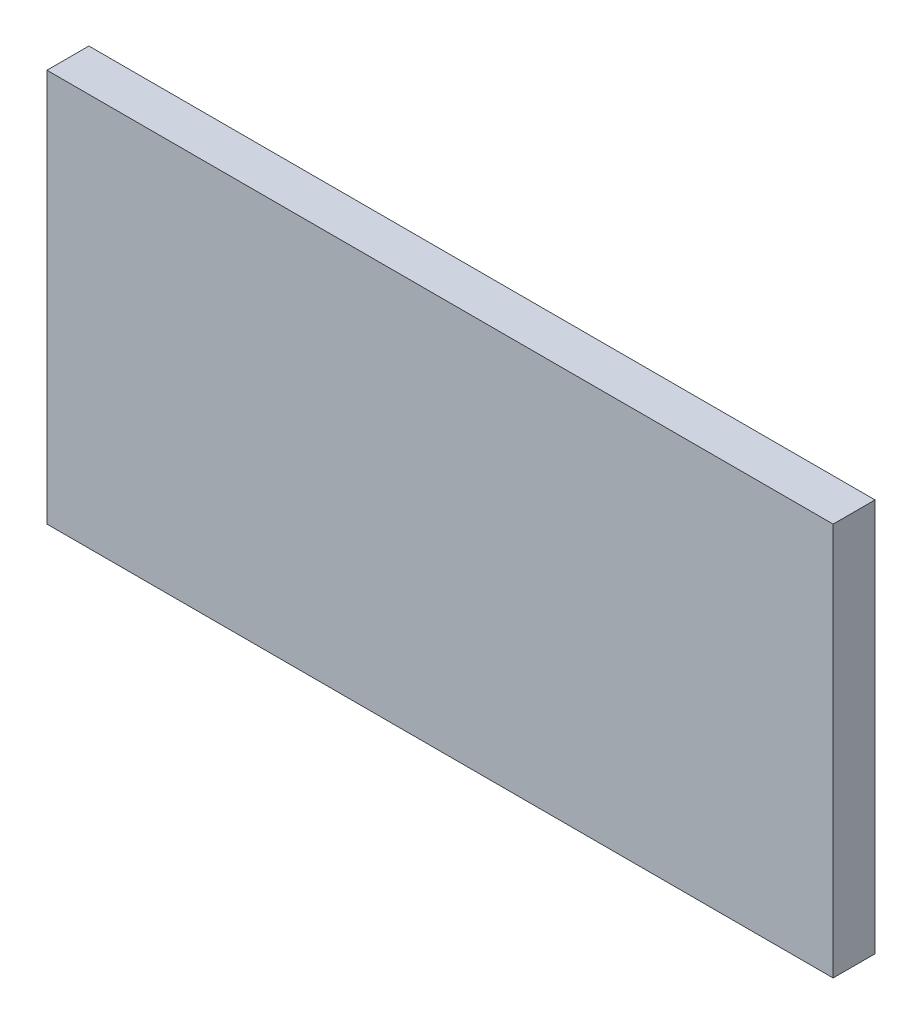
ISO-10303-21;
HEADER;
FILE_DESCRIPTION(('STEP AP214'),'2;1');
FILE_NAME('part.step','',(''),(''),'','','');
FILE_SCHEMA(('AUTOMOTIVE_DESIGN { 1 0 10303 214 1 1 1 1 }'));
ENDSEC;
DATA;
#1=APPLICATION_CONTEXT('core data for automotive mechanical design processes');
#2=APPLICATION_PROTOCOL_DEFINITION('international standard','automotive_design',2000,#1);
#3=PRODUCT_CONTEXT('',#1,'mechanical');
#4=PRODUCT('Part','Part','',(#3));
#5=PRODUCT_RELATED_PRODUCT_CATEGORY('part','',(#4));
#6=PRODUCT_DEFINITION_FORMATION('','',#4);
#7=PRODUCT_DEFINITION_CONTEXT('part definition',#1,'design');
#8=PRODUCT_DEFINITION('design','',#6,#7);
#9=PRODUCT_DEFINITION_SHAPE('','',#8);
#10=(LENGTH_UNIT() NAMED_UNIT(*) SI_UNIT(.MILLI.,.METRE.));
#11=(NAMED_UNIT(*) PLANE_ANGLE_UNIT() SI_UNIT($,.RADIAN.));
#12=(NAMED_UNIT(*) SI_UNIT($,.STERADIAN.) SOLID_ANGLE_UNIT());
#13=UNCERTAINTY_MEASURE_WITH_UNIT(LENGTH_MEASURE(1.E-05),#10,'distance_accuracy_value','');
#14=(GEOMETRIC_REPRESENTATION_CONTEXT(3) GLOBAL_UNCERTAINTY_ASSIGNED_CONTEXT((#13)) GLOBAL_UNIT_ASSIGNED_CONTEXT((#10,
#11,#12)) REPRESENTATION_CONTEXT('',''));
#15=CARTESIAN_POINT('',(0.,0.,0.));
#16=DIRECTION('',(0.,0.,1.));
#17=DIRECTION('',(1.,0.,0.));
#18=AXIS2_PLACEMENT_3D('',#15,#16,#17);
#19=CARTESIAN_POINT('',(-15.,7.5,1.6));
#20=DIRECTION('',(1.,0.,0.));
#21=DIRECTION('',(0.,1.,0.));
#22=AXIS2_PLACEMENT_3D('',#19,#20,#21);
#23=PLANE('',#22);
#24=DIRECTION('',(0.,-1.,0.));
#25=VECTOR('',#24,1.);
#26=CARTESIAN_POINT('',(-15.,7.5,0.));
#27=LINE('',#26,#25);
#28=CARTESIAN_POINT('',(-15.,7.5,0.));
#29=VERTEX_POINT('',#28);
#30=CARTESIAN_POINT('',(-15.,-7.5,0.));
#31=VERTEX_POINT('',#30);
#32=EDGE_CURVE('E117',#29,#31,#27,.T.);
#33=ORIENTED_EDGE('',*,*,#32,.T.);
#34=DIRECTION('',(0.,0.,-1.));
#35=VECTOR('',#34,1.);
#36=CARTESIAN_POINT('',(-15.,-7.5,1.6));
#37=LINE('',#36,#35);
#38=CARTESIAN_POINT('',(-15.,-7.5,1.6));
#39=VERTEX_POINT('',#38);
#40=EDGE_CURVE('E11',#39,#31,#37,.T.);
#41=ORIENTED_EDGE('',*,*,#40,.F.);
#42=DIRECTION('',(0.,-1.,0.));
#43=VECTOR('',#42,1.);
#44=CARTESIAN_POINT('',(-15.,7.5,1.6));
#45=LINE('',#44,#43);
#46=CARTESIAN_POINT('',(-15.,7.5,1.6));
#47=VERTEX_POINT('',#46);
#48=EDGE_CURVE('E101',#47,#39,#45,.T.);
#49=ORIENTED_EDGE('',*,*,#48,.F.);
#50=DIRECTION('',(0.,0.,-1.));
#51=VECTOR('',#50,1.);
#52=CARTESIAN_POINT('',(-15.,7.5,1.6));
#53=LINE('',#52,#51);
#54=EDGE_CURVE('E113',#47,#29,#53,.T.);
#55=ORIENTED_EDGE('',*,*,#54,.T.);
#56=EDGE_LOOP('',(#33,#41,#49,#55));
#57=FACE_BOUND('',#56,.T.);
#58=ADVANCED_FACE('F49',(#57),#23,.F.);
#59=CARTESIAN_POINT('',(15.,-7.5,1.6));
#60=DIRECTION('',(0.,1.,0.));
#61=DIRECTION('',(-1.,0.,0.));
#62=AXIS2_PLACEMENT_3D('',#59,#60,#61);
#63=PLANE('',#62);
#64=DIRECTION('',(1.,0.,0.));
#65=VECTOR('',#64,1.);
#66=CARTESIAN_POINT('',(15.,-7.5,0.));
#67=LINE('',#66,#65);
#68=CARTESIAN_POINT('',(15.,-7.5,0.));
#69=VERTEX_POINT('',#68);
#70=EDGE_CURVE('E106',#31,#69,#67,.T.);
#71=ORIENTED_EDGE('',*,*,#70,.T.);
#72=DIRECTION('',(0.,0.,-1.));
#73=VECTOR('',#72,1.);
#74=CARTESIAN_POINT('',(15.,-7.5,1.6));
#75=LINE('',#74,#73);
#76=CARTESIAN_POINT('',(15.,-7.5,1.6));
#77=VERTEX_POINT('',#76);
#78=EDGE_CURVE('E58',#77,#69,#75,.T.);
#79=ORIENTED_EDGE('',*,*,#78,.F.);
#80=DIRECTION('',(1.,0.,0.));
#81=VECTOR('',#80,1.);
#82=CARTESIAN_POINT('',(15.,-7.5,1.6));
#83=LINE('',#82,#81);
#84=EDGE_CURVE('E96',#39,#77,#83,.T.);
#85=ORIENTED_EDGE('',*,*,#84,.F.);
#86=ORIENTED_EDGE('',*,*,#40,.T.);
#87=EDGE_LOOP('',(#71,#79,#85,#86));
#88=FACE_BOUND('',#87,.T.);
#89=ADVANCED_FACE('F105',(#88),#63,.F.);
#90=CARTESIAN_POINT('',(15.,7.5,1.6));
#91=DIRECTION('',(-1.,0.,0.));
#92=DIRECTION('',(0.,0.,1.));
#93=AXIS2_PLACEMENT_3D('',#90,#91,#92);
#94=PLANE('',#93);
#95=DIRECTION('',(0.,1.,0.));
#96=VECTOR('',#95,1.);
#97=CARTESIAN_POINT('',(15.,7.5,0.));
#98=LINE('',#97,#96);
#99=CARTESIAN_POINT('',(15.,7.5,0.));
#100=VERTEX_POINT('',#99);
#101=EDGE_CURVE('E83',#69,#100,#98,.T.);
#102=ORIENTED_EDGE('',*,*,#101,.T.);
#103=DIRECTION('',(0.,0.,-1.));
#104=VECTOR('',#103,1.);
#105=CARTESIAN_POINT('',(15.,7.5,1.6));
#106=LINE('',#105,#104);
#107=CARTESIAN_POINT('',(15.,7.5,1.6));
#108=VERTEX_POINT('',#107);
#109=EDGE_CURVE('E108',#108,#100,#106,.T.);
#110=ORIENTED_EDGE('',*,*,#109,.F.);
#111=DIRECTION('',(0.,1.,0.));
#112=VECTOR('',#111,1.);
#113=CARTESIAN_POINT('',(15.,7.5,1.6));
#114=LINE('',#113,#112);
#115=EDGE_CURVE('E99',#77,#108,#114,.T.);
#116=ORIENTED_EDGE('',*,*,#115,.F.);
#117=ORIENTED_EDGE('',*,*,#78,.T.);
#118=EDGE_LOOP('',(#102,#110,#116,#117));
#119=FACE_BOUND('',#118,.T.);
#120=ADVANCED_FACE('F109',(#119),#94,.F.);
#121=CARTESIAN_POINT('',(15.,7.5,1.6));
#122=DIRECTION('',(0.,-1.,0.));
#123=DIRECTION('',(1.,0.,0.));
#124=AXIS2_PLACEMENT_3D('',#121,#122,#123);
#125=PLANE('',#124);
#126=DIRECTION('',(-1.,0.,0.));
#127=VECTOR('',#126,1.);
#128=CARTESIAN_POINT('',(15.,7.5,0.));
#129=LINE('',#128,#127);
#130=EDGE_CURVE('E89',#100,#29,#129,.T.);
#131=ORIENTED_EDGE('',*,*,#130,.T.);
#132=ORIENTED_EDGE('',*,*,#54,.F.);
#133=DIRECTION('',(-1.,0.,0.));
#134=VECTOR('',#133,1.);
#135=CARTESIAN_POINT('',(15.,7.5,1.6));
#136=LINE('',#135,#134);
#137=EDGE_CURVE('E66',#108,#47,#136,.T.);
#138=ORIENTED_EDGE('',*,*,#137,.F.);
#139=ORIENTED_EDGE('',*,*,#109,.T.);
#140=EDGE_LOOP('',(#131,#132,#138,#139));
#141=FACE_BOUND('',#140,.T.);
#142=ADVANCED_FACE('F130',(#141),#125,.F.);
#143=CARTESIAN_POINT('',(0.,0.,1.6));
#144=DIRECTION('',(0.,0.,-1.));
#145=DIRECTION('',(-1.,0.,0.));
#146=AXIS2_PLACEMENT_3D('',#143,#144,#145);
#147=PLANE('',#146);
#148=ORIENTED_EDGE('',*,*,#48,.T.);
#149=ORIENTED_EDGE('',*,*,#84,.T.);
#150=ORIENTED_EDGE('',*,*,#115,.T.);
#151=ORIENTED_EDGE('',*,*,#137,.T.);
#152=EDGE_LOOP('',(#148,#149,#150,#151));
#153=FACE_BOUND('',#152,.T.);
#154=ADVANCED_FACE('F97',(#153),#147,.F.);
#155=CARTESIAN_POINT('',(0.,0.,0.));
#156=DIRECTION('',(0.,0.,-1.));
#157=DIRECTION('',(-1.,0.,0.));
#158=AXIS2_PLACEMENT_3D('',#155,#156,#157);
#159=PLANE('',#158);
#160=ORIENTED_EDGE('',*,*,#32,.F.);
#161=ORIENTED_EDGE('',*,*,#130,.F.);
#162=ORIENTED_EDGE('',*,*,#101,.F.);
#163=ORIENTED_EDGE('',*,*,#70,.F.);
#164=EDGE_LOOP('',(#160,#161,#162,#163));
#165=FACE_BOUND('',#164,.T.);
#166=ADVANCED_FACE('F133',(#165),#159,.T.);
#167=CLOSED_SHELL('',(#58,#89,#120,#142,#154,#166));
#168=MANIFOLD_SOLID_BREP('B2',#167);
#169=ADVANCED_BREP_SHAPE_REPRESENTATION('',(#18,#168),#14);
#170=SHAPE_DEFINITION_REPRESENTATION(#9,#169);
ENDSEC;
END-ISO-10303-21;
